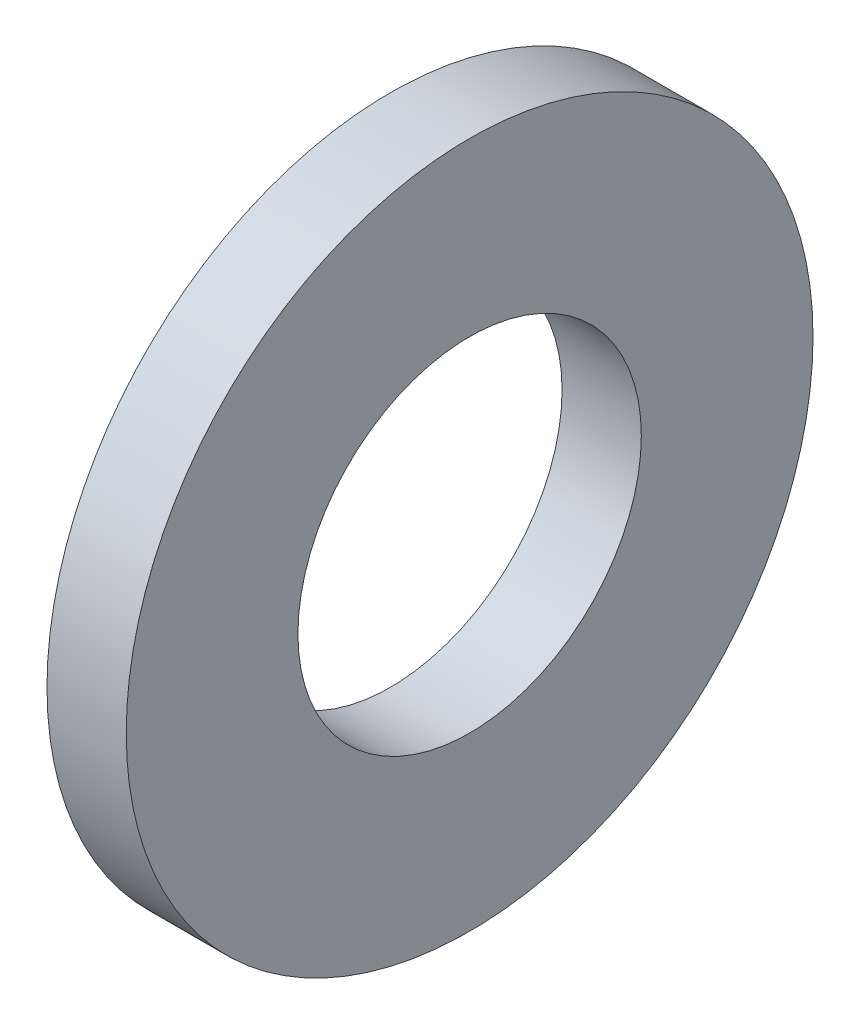
ISO-10303-21;
HEADER;
FILE_DESCRIPTION(('STEP AP214'),'2;1');
FILE_NAME('part.step','',(''),(''),'','','');
FILE_SCHEMA(('AUTOMOTIVE_DESIGN { 1 0 10303 214 1 1 1 1 }'));
ENDSEC;
DATA;
#1=APPLICATION_CONTEXT('core data for automotive mechanical design processes');
#2=APPLICATION_PROTOCOL_DEFINITION('international standard','automotive_design',2000,#1);
#3=PRODUCT_CONTEXT('',#1,'mechanical');
#4=PRODUCT('Part','Part','',(#3));
#5=PRODUCT_RELATED_PRODUCT_CATEGORY('part','',(#4));
#6=PRODUCT_DEFINITION_FORMATION('','',#4);
#7=PRODUCT_DEFINITION_CONTEXT('part definition',#1,'design');
#8=PRODUCT_DEFINITION('design','',#6,#7);
#9=PRODUCT_DEFINITION_SHAPE('','',#8);
#10=(LENGTH_UNIT() NAMED_UNIT(*) SI_UNIT(.MILLI.,.METRE.));
#11=(NAMED_UNIT(*) PLANE_ANGLE_UNIT() SI_UNIT($,.RADIAN.));
#12=(NAMED_UNIT(*) SI_UNIT($,.STERADIAN.) SOLID_ANGLE_UNIT());
#13=UNCERTAINTY_MEASURE_WITH_UNIT(LENGTH_MEASURE(1.E-05),#10,'distance_accuracy_value','');
#14=(GEOMETRIC_REPRESENTATION_CONTEXT(3) GLOBAL_UNCERTAINTY_ASSIGNED_CONTEXT((#13)) GLOBAL_UNIT_ASSIGNED_CONTEXT((#10,
#11,#12)) REPRESENTATION_CONTEXT('',''));
#15=CARTESIAN_POINT('',(0.,0.,0.));
#16=DIRECTION('',(0.,0.,1.));
#17=DIRECTION('',(1.,0.,0.));
#18=AXIS2_PLACEMENT_3D('',#15,#16,#17);
#19=CARTESIAN_POINT('',(0.9144,0.,0.));
#20=DIRECTION('',(1.,0.,0.));
#21=DIRECTION('',(0.,0.,-1.));
#22=AXIS2_PLACEMENT_3D('',#19,#20,#21);
#23=PLANE('',#22);
#24=CARTESIAN_POINT('',(0.9144,0.,0.));
#25=DIRECTION('',(1.,0.,0.));
#26=DIRECTION('',(0.,0.,-1.));
#27=AXIS2_PLACEMENT_3D('',#24,#25,#26);
#28=CIRCLE('',#27,3.9624);
#29=CARTESIAN_POINT('',(0.9144,0.,-3.9624));
#30=VERTEX_POINT('',#29);
#31=EDGE_CURVE('E10',#30,#30,#28,.T.);
#32=ORIENTED_EDGE('',*,*,#31,.T.);
#33=EDGE_LOOP('',(#32));
#34=FACE_BOUND('',#33,.T.);
#35=CARTESIAN_POINT('',(0.9144,0.,0.));
#36=DIRECTION('',(1.,0.,0.));
#37=DIRECTION('',(0.,0.,-1.));
#38=AXIS2_PLACEMENT_3D('',#35,#36,#37);
#39=CIRCLE('',#38,1.9812);
#40=CARTESIAN_POINT('',(0.9144,0.,-1.9812));
#41=VERTEX_POINT('',#40);
#42=EDGE_CURVE('E41',#41,#41,#39,.T.);
#43=ORIENTED_EDGE('',*,*,#42,.F.);
#44=EDGE_LOOP('',(#43));
#45=FACE_BOUND('',#44,.T.);
#46=ADVANCED_FACE('F30',(#34,#45),#23,.T.);
#47=CARTESIAN_POINT('',(0.,0.,0.));
#48=DIRECTION('',(1.,0.,0.));
#49=DIRECTION('',(0.,0.,-1.));
#50=AXIS2_PLACEMENT_3D('',#47,#48,#49);
#51=PLANE('',#50);
#52=CARTESIAN_POINT('',(0.,0.,0.));
#53=DIRECTION('',(1.,0.,0.));
#54=DIRECTION('',(0.,0.,-1.));
#55=AXIS2_PLACEMENT_3D('',#52,#53,#54);
#56=CIRCLE('',#55,3.9624);
#57=CARTESIAN_POINT('',(0.,0.,-3.9624));
#58=VERTEX_POINT('',#57);
#59=EDGE_CURVE('E34',#58,#58,#56,.T.);
#60=ORIENTED_EDGE('',*,*,#59,.F.);
#61=EDGE_LOOP('',(#60));
#62=FACE_BOUND('',#61,.T.);
#63=CARTESIAN_POINT('',(0.,0.,0.));
#64=DIRECTION('',(1.,0.,0.));
#65=DIRECTION('',(0.,0.,-1.));
#66=AXIS2_PLACEMENT_3D('',#63,#64,#65);
#67=CIRCLE('',#66,1.9812);
#68=CARTESIAN_POINT('',(0.,0.,-1.9812));
#69=VERTEX_POINT('',#68);
#70=EDGE_CURVE('E43',#69,#69,#67,.T.);
#71=ORIENTED_EDGE('',*,*,#70,.T.);
#72=EDGE_LOOP('',(#71));
#73=FACE_BOUND('',#72,.T.);
#74=ADVANCED_FACE('F53',(#62,#73),#51,.F.);
#75=CARTESIAN_POINT('',(0.9144,0.,0.));
#76=DIRECTION('',(-1.,0.,0.));
#77=DIRECTION('',(0.,0.,1.));
#78=AXIS2_PLACEMENT_3D('',#75,#76,#77);
#79=CYLINDRICAL_SURFACE('',#78,3.9624);
#80=ORIENTED_EDGE('',*,*,#31,.F.);
#81=EDGE_LOOP('',(#80));
#82=FACE_BOUND('',#81,.T.);
#83=ORIENTED_EDGE('',*,*,#59,.T.);
#84=EDGE_LOOP('',(#83));
#85=FACE_BOUND('',#84,.T.);
#86=ADVANCED_FACE('F32',(#82,#85),#79,.T.);
#87=CARTESIAN_POINT('',(0.9144,0.,0.));
#88=DIRECTION('',(-1.,0.,0.));
#89=DIRECTION('',(0.,0.,1.));
#90=AXIS2_PLACEMENT_3D('',#87,#88,#89);
#91=CYLINDRICAL_SURFACE('',#90,1.9812);
#92=ORIENTED_EDGE('',*,*,#42,.T.);
#93=EDGE_LOOP('',(#92));
#94=FACE_BOUND('',#93,.T.);
#95=ORIENTED_EDGE('',*,*,#70,.F.);
#96=EDGE_LOOP('',(#95));
#97=FACE_BOUND('',#96,.T.);
#98=ADVANCED_FACE('F49',(#94,#97),#91,.F.);
#99=CLOSED_SHELL('',(#46,#74,#86,#98));
#100=MANIFOLD_SOLID_BREP('B2',#99);
#101=ADVANCED_BREP_SHAPE_REPRESENTATION('',(#18,#100),#14);
#102=SHAPE_DEFINITION_REPRESENTATION(#9,#101);
ENDSEC;
END-ISO-10303-21;
